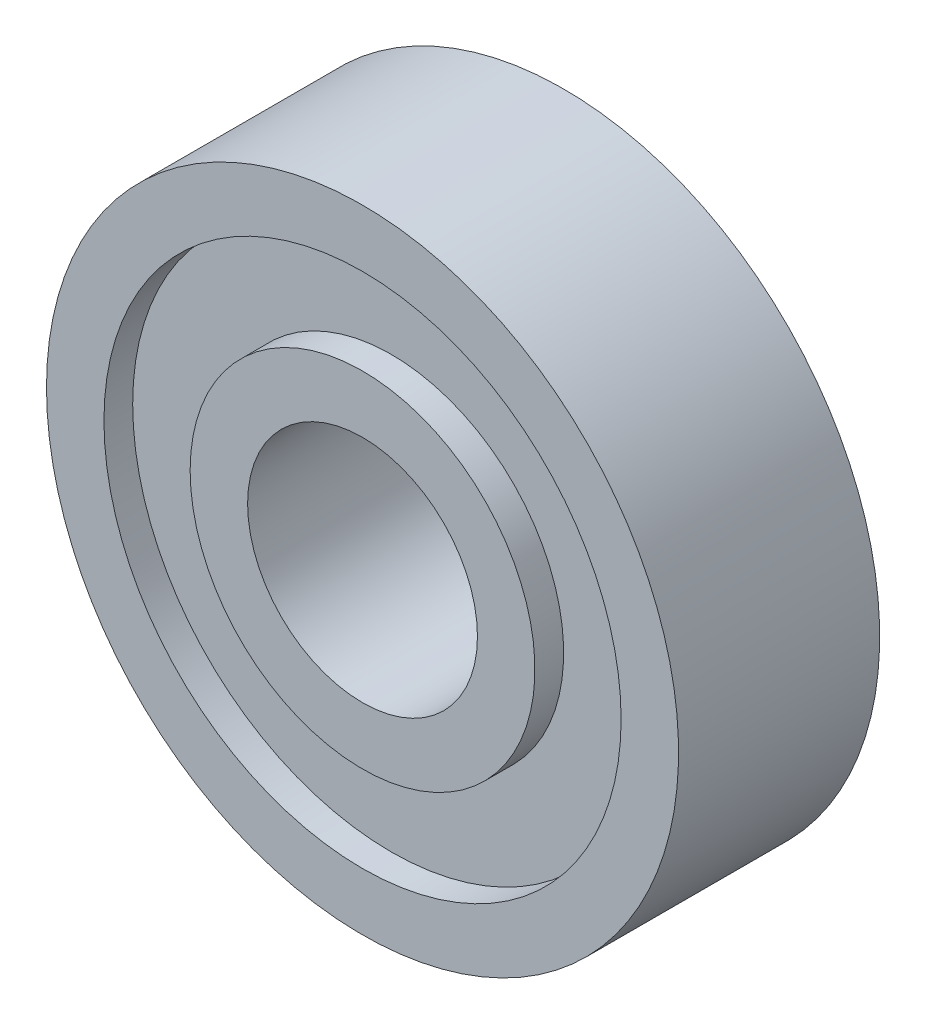
ISO-10303-21;
HEADER;
FILE_DESCRIPTION(('STEP AP214'),'2;1');
FILE_NAME('part.step','',(''),(''),'','','');
FILE_SCHEMA(('AUTOMOTIVE_DESIGN { 1 0 10303 214 1 1 1 1 }'));
ENDSEC;
DATA;
#1=APPLICATION_CONTEXT('core data for automotive mechanical design processes');
#2=APPLICATION_PROTOCOL_DEFINITION('international standard','automotive_design',2000,#1);
#3=PRODUCT_CONTEXT('',#1,'mechanical');
#4=PRODUCT('Part','Part','',(#3));
#5=PRODUCT_RELATED_PRODUCT_CATEGORY('part','',(#4));
#6=PRODUCT_DEFINITION_FORMATION('','',#4);
#7=PRODUCT_DEFINITION_CONTEXT('part definition',#1,'design');
#8=PRODUCT_DEFINITION('design','',#6,#7);
#9=PRODUCT_DEFINITION_SHAPE('','',#8);
#10=(LENGTH_UNIT() NAMED_UNIT(*) SI_UNIT(.MILLI.,.METRE.));
#11=(NAMED_UNIT(*) PLANE_ANGLE_UNIT() SI_UNIT($,.RADIAN.));
#12=(NAMED_UNIT(*) SI_UNIT($,.STERADIAN.) SOLID_ANGLE_UNIT());
#13=UNCERTAINTY_MEASURE_WITH_UNIT(LENGTH_MEASURE(1.E-05),#10,'distance_accuracy_value','');
#14=(GEOMETRIC_REPRESENTATION_CONTEXT(3) GLOBAL_UNCERTAINTY_ASSIGNED_CONTEXT((#13)) GLOBAL_UNIT_ASSIGNED_CONTEXT((#10,
#11,#12)) REPRESENTATION_CONTEXT('',''));
#15=CARTESIAN_POINT('',(0.,0.,0.));
#16=DIRECTION('',(0.,0.,1.));
#17=DIRECTION('',(1.,0.,0.));
#18=AXIS2_PLACEMENT_3D('',#15,#16,#17);
#19=CARTESIAN_POINT('',(4.,0.,-3.5));
#20=DIRECTION('',(0.,0.,-1.));
#21=DIRECTION('',(-1.,0.,0.));
#22=AXIS2_PLACEMENT_3D('',#19,#20,#21);
#23=PLANE('',#22);
#24=CARTESIAN_POINT('',(0.,0.,-3.5));
#25=DIRECTION('',(0.,0.,-1.));
#26=DIRECTION('',(-1.,0.,0.));
#27=AXIS2_PLACEMENT_3D('',#24,#25,#26);
#28=CIRCLE('',#27,6.);
#29=CARTESIAN_POINT('',(-6.,0.,-3.5));
#30=VERTEX_POINT('',#29);
#31=EDGE_CURVE('E10',#30,#30,#28,.T.);
#32=ORIENTED_EDGE('',*,*,#31,.T.);
#33=EDGE_LOOP('',(#32));
#34=FACE_BOUND('',#33,.T.);
#35=CARTESIAN_POINT('',(0.,0.,-3.5));
#36=DIRECTION('',(0.,0.,-1.));
#37=DIRECTION('',(-1.,0.,0.));
#38=AXIS2_PLACEMENT_3D('',#35,#36,#37);
#39=CIRCLE('',#38,4.);
#40=CARTESIAN_POINT('',(-4.,0.,-3.5));
#41=VERTEX_POINT('',#40);
#42=EDGE_CURVE('E68',#41,#41,#39,.T.);
#43=ORIENTED_EDGE('',*,*,#42,.F.);
#44=EDGE_LOOP('',(#43));
#45=FACE_BOUND('',#44,.T.);
#46=ADVANCED_FACE('F28',(#34,#45),#23,.T.);
#47=CARTESIAN_POINT('',(0.,0.,3.5));
#48=DIRECTION('',(0.,0.,-1.));
#49=DIRECTION('',(-1.,0.,0.));
#50=AXIS2_PLACEMENT_3D('',#47,#48,#49);
#51=CYLINDRICAL_SURFACE('',#50,6.);
#52=CARTESIAN_POINT('',(0.,0.,-2.5));
#53=DIRECTION('',(0.,0.,-1.));
#54=DIRECTION('',(-1.,0.,0.));
#55=AXIS2_PLACEMENT_3D('',#52,#53,#54);
#56=CIRCLE('',#55,6.);
#57=CARTESIAN_POINT('',(-6.,0.,-2.5));
#58=VERTEX_POINT('',#57);
#59=EDGE_CURVE('E34',#58,#58,#56,.T.);
#60=ORIENTED_EDGE('',*,*,#59,.T.);
#61=EDGE_LOOP('',(#60));
#62=FACE_BOUND('',#61,.T.);
#63=ORIENTED_EDGE('',*,*,#31,.F.);
#64=EDGE_LOOP('',(#63));
#65=FACE_BOUND('',#64,.T.);
#66=ADVANCED_FACE('F76',(#62,#65),#51,.T.);
#67=CARTESIAN_POINT('',(6.,0.,-2.5));
#68=DIRECTION('',(0.,0.,-1.));
#69=DIRECTION('',(-1.,0.,0.));
#70=AXIS2_PLACEMENT_3D('',#67,#68,#69);
#71=PLANE('',#70);
#72=CARTESIAN_POINT('',(0.,0.,-2.5));
#73=DIRECTION('',(0.,0.,-1.));
#74=DIRECTION('',(-1.,0.,0.));
#75=AXIS2_PLACEMENT_3D('',#72,#73,#74);
#76=CIRCLE('',#75,9.);
#77=CARTESIAN_POINT('',(-9.,0.,-2.5));
#78=VERTEX_POINT('',#77);
#79=EDGE_CURVE('E38',#78,#78,#76,.T.);
#80=ORIENTED_EDGE('',*,*,#79,.T.);
#81=EDGE_LOOP('',(#80));
#82=FACE_BOUND('',#81,.T.);
#83=ORIENTED_EDGE('',*,*,#59,.F.);
#84=EDGE_LOOP('',(#83));
#85=FACE_BOUND('',#84,.T.);
#86=ADVANCED_FACE('F80',(#82,#85),#71,.T.);
#87=CARTESIAN_POINT('',(0.,0.,3.5));
#88=DIRECTION('',(0.,0.,-1.));
#89=DIRECTION('',(-1.,0.,0.));
#90=AXIS2_PLACEMENT_3D('',#87,#88,#89);
#91=CYLINDRICAL_SURFACE('',#90,9.);
#92=CARTESIAN_POINT('',(0.,0.,-3.5));
#93=DIRECTION('',(0.,0.,-1.));
#94=DIRECTION('',(-1.,0.,0.));
#95=AXIS2_PLACEMENT_3D('',#92,#93,#94);
#96=CIRCLE('',#95,9.);
#97=CARTESIAN_POINT('',(-9.,0.,-3.5));
#98=VERTEX_POINT('',#97);
#99=EDGE_CURVE('E42',#98,#98,#96,.T.);
#100=ORIENTED_EDGE('',*,*,#99,.T.);
#101=EDGE_LOOP('',(#100));
#102=FACE_BOUND('',#101,.T.);
#103=ORIENTED_EDGE('',*,*,#79,.F.);
#104=EDGE_LOOP('',(#103));
#105=FACE_BOUND('',#104,.T.);
#106=ADVANCED_FACE('F84',(#102,#105),#91,.F.);
#107=CARTESIAN_POINT('',(9.,0.,-3.5));
#108=DIRECTION('',(0.,0.,-1.));
#109=DIRECTION('',(-1.,0.,0.));
#110=AXIS2_PLACEMENT_3D('',#107,#108,#109);
#111=PLANE('',#110);
#112=CARTESIAN_POINT('',(0.,0.,-3.5));
#113=DIRECTION('',(0.,0.,-1.));
#114=DIRECTION('',(-1.,0.,0.));
#115=AXIS2_PLACEMENT_3D('',#112,#113,#114);
#116=CIRCLE('',#115,11.);
#117=CARTESIAN_POINT('',(-11.,0.,-3.5));
#118=VERTEX_POINT('',#117);
#119=EDGE_CURVE('E47',#118,#118,#116,.T.);
#120=ORIENTED_EDGE('',*,*,#119,.T.);
#121=EDGE_LOOP('',(#120));
#122=FACE_BOUND('',#121,.T.);
#123=ORIENTED_EDGE('',*,*,#99,.F.);
#124=EDGE_LOOP('',(#123));
#125=FACE_BOUND('',#124,.T.);
#126=ADVANCED_FACE('F91',(#122,#125),#111,.T.);
#127=CARTESIAN_POINT('',(0.,0.,3.5));
#128=DIRECTION('',(0.,0.,-1.));
#129=DIRECTION('',(-1.,0.,0.));
#130=AXIS2_PLACEMENT_3D('',#127,#128,#129);
#131=CYLINDRICAL_SURFACE('',#130,11.);
#132=CARTESIAN_POINT('',(0.,0.,3.5));
#133=DIRECTION('',(0.,0.,-1.));
#134=DIRECTION('',(-1.,0.,0.));
#135=AXIS2_PLACEMENT_3D('',#132,#133,#134);
#136=CIRCLE('',#135,11.);
#137=CARTESIAN_POINT('',(-11.,0.,3.5));
#138=VERTEX_POINT('',#137);
#139=EDGE_CURVE('E50',#138,#138,#136,.T.);
#140=ORIENTED_EDGE('',*,*,#139,.T.);
#141=EDGE_LOOP('',(#140));
#142=FACE_BOUND('',#141,.T.);
#143=ORIENTED_EDGE('',*,*,#119,.F.);
#144=EDGE_LOOP('',(#143));
#145=FACE_BOUND('',#144,.T.);
#146=ADVANCED_FACE('F95',(#142,#145),#131,.T.);
#147=CARTESIAN_POINT('',(11.,0.,3.5));
#148=DIRECTION('',(0.,0.,1.));
#149=DIRECTION('',(1.,0.,0.));
#150=AXIS2_PLACEMENT_3D('',#147,#148,#149);
#151=PLANE('',#150);
#152=CARTESIAN_POINT('',(0.,0.,3.5));
#153=DIRECTION('',(0.,0.,-1.));
#154=DIRECTION('',(-1.,0.,0.));
#155=AXIS2_PLACEMENT_3D('',#152,#153,#154);
#156=CIRCLE('',#155,9.);
#157=CARTESIAN_POINT('',(-9.,0.,3.5));
#158=VERTEX_POINT('',#157);
#159=EDGE_CURVE('E53',#158,#158,#156,.T.);
#160=ORIENTED_EDGE('',*,*,#159,.T.);
#161=EDGE_LOOP('',(#160));
#162=FACE_BOUND('',#161,.T.);
#163=ORIENTED_EDGE('',*,*,#139,.F.);
#164=EDGE_LOOP('',(#163));
#165=FACE_BOUND('',#164,.T.);
#166=ADVANCED_FACE('F99',(#162,#165),#151,.T.);
#167=CARTESIAN_POINT('',(0.,0.,3.5));
#168=DIRECTION('',(0.,0.,-1.));
#169=DIRECTION('',(-1.,0.,0.));
#170=AXIS2_PLACEMENT_3D('',#167,#168,#169);
#171=CYLINDRICAL_SURFACE('',#170,9.);
#172=CARTESIAN_POINT('',(0.,0.,2.5));
#173=DIRECTION('',(0.,0.,-1.));
#174=DIRECTION('',(-1.,0.,0.));
#175=AXIS2_PLACEMENT_3D('',#172,#173,#174);
#176=CIRCLE('',#175,9.);
#177=CARTESIAN_POINT('',(-9.,0.,2.5));
#178=VERTEX_POINT('',#177);
#179=EDGE_CURVE('E56',#178,#178,#176,.T.);
#180=ORIENTED_EDGE('',*,*,#179,.T.);
#181=EDGE_LOOP('',(#180));
#182=FACE_BOUND('',#181,.T.);
#183=ORIENTED_EDGE('',*,*,#159,.F.);
#184=EDGE_LOOP('',(#183));
#185=FACE_BOUND('',#184,.T.);
#186=ADVANCED_FACE('F103',(#182,#185),#171,.F.);
#187=CARTESIAN_POINT('',(9.,0.,2.5));
#188=DIRECTION('',(0.,0.,1.));
#189=DIRECTION('',(1.,0.,0.));
#190=AXIS2_PLACEMENT_3D('',#187,#188,#189);
#191=PLANE('',#190);
#192=CARTESIAN_POINT('',(0.,0.,2.5));
#193=DIRECTION('',(0.,0.,-1.));
#194=DIRECTION('',(-1.,0.,0.));
#195=AXIS2_PLACEMENT_3D('',#192,#193,#194);
#196=CIRCLE('',#195,6.);
#197=CARTESIAN_POINT('',(-6.,0.,2.5));
#198=VERTEX_POINT('',#197);
#199=EDGE_CURVE('E59',#198,#198,#196,.T.);
#200=ORIENTED_EDGE('',*,*,#199,.T.);
#201=EDGE_LOOP('',(#200));
#202=FACE_BOUND('',#201,.T.);
#203=ORIENTED_EDGE('',*,*,#179,.F.);
#204=EDGE_LOOP('',(#203));
#205=FACE_BOUND('',#204,.T.);
#206=ADVANCED_FACE('F107',(#202,#205),#191,.T.);
#207=CARTESIAN_POINT('',(0.,0.,3.5));
#208=DIRECTION('',(0.,0.,-1.));
#209=DIRECTION('',(-1.,0.,0.));
#210=AXIS2_PLACEMENT_3D('',#207,#208,#209);
#211=CYLINDRICAL_SURFACE('',#210,6.);
#212=CARTESIAN_POINT('',(0.,0.,3.5));
#213=DIRECTION('',(0.,0.,-1.));
#214=DIRECTION('',(-1.,0.,0.));
#215=AXIS2_PLACEMENT_3D('',#212,#213,#214);
#216=CIRCLE('',#215,6.);
#217=CARTESIAN_POINT('',(-6.,0.,3.5));
#218=VERTEX_POINT('',#217);
#219=EDGE_CURVE('E62',#218,#218,#216,.T.);
#220=ORIENTED_EDGE('',*,*,#219,.T.);
#221=EDGE_LOOP('',(#220));
#222=FACE_BOUND('',#221,.T.);
#223=ORIENTED_EDGE('',*,*,#199,.F.);
#224=EDGE_LOOP('',(#223));
#225=FACE_BOUND('',#224,.T.);
#226=ADVANCED_FACE('F111',(#222,#225),#211,.T.);
#227=CARTESIAN_POINT('',(6.,0.,3.5));
#228=DIRECTION('',(0.,0.,1.));
#229=DIRECTION('',(1.,0.,0.));
#230=AXIS2_PLACEMENT_3D('',#227,#228,#229);
#231=PLANE('',#230);
#232=CARTESIAN_POINT('',(0.,0.,3.5));
#233=DIRECTION('',(0.,0.,-1.));
#234=DIRECTION('',(-1.,0.,0.));
#235=AXIS2_PLACEMENT_3D('',#232,#233,#234);
#236=CIRCLE('',#235,4.);
#237=CARTESIAN_POINT('',(-4.,0.,3.5));
#238=VERTEX_POINT('',#237);
#239=EDGE_CURVE('E65',#238,#238,#236,.T.);
#240=ORIENTED_EDGE('',*,*,#239,.T.);
#241=EDGE_LOOP('',(#240));
#242=FACE_BOUND('',#241,.T.);
#243=ORIENTED_EDGE('',*,*,#219,.F.);
#244=EDGE_LOOP('',(#243));
#245=FACE_BOUND('',#244,.T.);
#246=ADVANCED_FACE('F115',(#242,#245),#231,.T.);
#247=CARTESIAN_POINT('',(0.,0.,3.5));
#248=DIRECTION('',(0.,0.,-1.));
#249=DIRECTION('',(-1.,0.,0.));
#250=AXIS2_PLACEMENT_3D('',#247,#248,#249);
#251=CYLINDRICAL_SURFACE('',#250,4.);
#252=ORIENTED_EDGE('',*,*,#42,.T.);
#253=EDGE_LOOP('',(#252));
#254=FACE_BOUND('',#253,.T.);
#255=ORIENTED_EDGE('',*,*,#239,.F.);
#256=EDGE_LOOP('',(#255));
#257=FACE_BOUND('',#256,.T.);
#258=ADVANCED_FACE('F72',(#254,#257),#251,.F.);
#259=CLOSED_SHELL('',(#46,#66,#86,#106,#126,#146,#166,#186,#206,#226,#246,#258));
#260=MANIFOLD_SOLID_BREP('B2',#259);
#261=ADVANCED_BREP_SHAPE_REPRESENTATION('',(#18,#260),#14);
#262=SHAPE_DEFINITION_REPRESENTATION(#9,#261);
ENDSEC;
END-ISO-10303-21;
